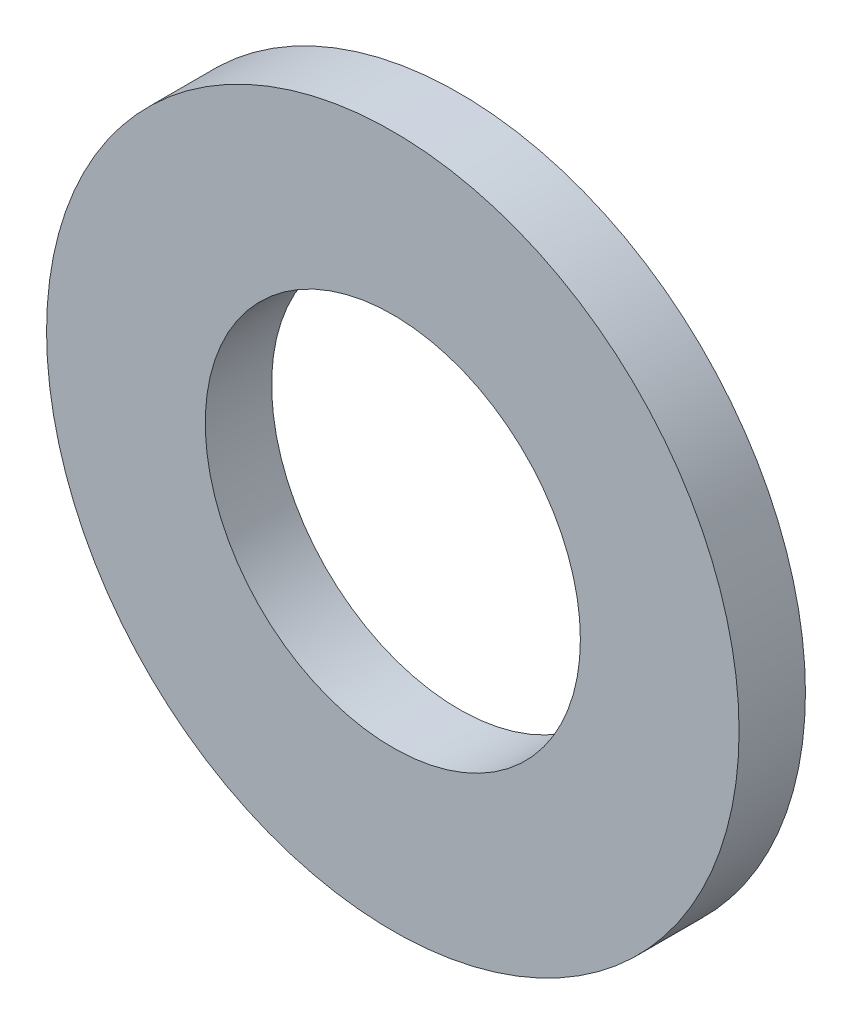
ISO-10303-21;
HEADER;
FILE_DESCRIPTION(('STEP AP214'),'2;1');
FILE_NAME('part.step','',(''),(''),'','','');
FILE_SCHEMA(('AUTOMOTIVE_DESIGN { 1 0 10303 214 1 1 1 1 }'));
ENDSEC;
DATA;
#1=APPLICATION_CONTEXT('core data for automotive mechanical design processes');
#2=APPLICATION_PROTOCOL_DEFINITION('international standard','automotive_design',2000,#1);
#3=PRODUCT_CONTEXT('',#1,'mechanical');
#4=PRODUCT('Part','Part','',(#3));
#5=PRODUCT_RELATED_PRODUCT_CATEGORY('part','',(#4));
#6=PRODUCT_DEFINITION_FORMATION('','',#4);
#7=PRODUCT_DEFINITION_CONTEXT('part definition',#1,'design');
#8=PRODUCT_DEFINITION('design','',#6,#7);
#9=PRODUCT_DEFINITION_SHAPE('','',#8);
#10=(LENGTH_UNIT() NAMED_UNIT(*) SI_UNIT(.MILLI.,.METRE.));
#11=(NAMED_UNIT(*) PLANE_ANGLE_UNIT() SI_UNIT($,.RADIAN.));
#12=(NAMED_UNIT(*) SI_UNIT($,.STERADIAN.) SOLID_ANGLE_UNIT());
#13=UNCERTAINTY_MEASURE_WITH_UNIT(LENGTH_MEASURE(1.E-05),#10,'distance_accuracy_value','');
#14=(GEOMETRIC_REPRESENTATION_CONTEXT(3) GLOBAL_UNCERTAINTY_ASSIGNED_CONTEXT((#13)) GLOBAL_UNIT_ASSIGNED_CONTEXT((#10,
#11,#12)) REPRESENTATION_CONTEXT('',''));
#15=CARTESIAN_POINT('',(0.,0.,0.));
#16=DIRECTION('',(0.,0.,1.));
#17=DIRECTION('',(1.,0.,0.));
#18=AXIS2_PLACEMENT_3D('',#15,#16,#17);
#19=CARTESIAN_POINT('',(0.,0.,-2.3));
#20=DIRECTION('',(0.,0.,1.));
#21=DIRECTION('',(1.,0.,0.));
#22=AXIS2_PLACEMENT_3D('',#19,#20,#21);
#23=CYLINDRICAL_SURFACE('',#22,12.);
#24=CARTESIAN_POINT('',(0.,0.,-2.3));
#25=DIRECTION('',(0.,0.,1.));
#26=DIRECTION('',(1.,0.,0.));
#27=AXIS2_PLACEMENT_3D('',#24,#25,#26);
#28=CIRCLE('',#27,12.);
#29=CARTESIAN_POINT('',(12.,0.,-2.3));
#30=VERTEX_POINT('',#29);
#31=EDGE_CURVE('E10',#30,#30,#28,.T.);
#32=ORIENTED_EDGE('',*,*,#31,.T.);
#33=EDGE_LOOP('',(#32));
#34=FACE_BOUND('',#33,.T.);
#35=CARTESIAN_POINT('',(0.,0.,0.));
#36=DIRECTION('',(0.,0.,1.));
#37=DIRECTION('',(1.,0.,0.));
#38=AXIS2_PLACEMENT_3D('',#35,#36,#37);
#39=CIRCLE('',#38,12.);
#40=CARTESIAN_POINT('',(12.,0.,0.));
#41=VERTEX_POINT('',#40);
#42=EDGE_CURVE('E32',#41,#41,#39,.T.);
#43=ORIENTED_EDGE('',*,*,#42,.F.);
#44=EDGE_LOOP('',(#43));
#45=FACE_BOUND('',#44,.T.);
#46=ADVANCED_FACE('F29',(#34,#45),#23,.T.);
#47=CARTESIAN_POINT('',(0.,0.,-2.3));
#48=DIRECTION('',(0.,0.,1.));
#49=DIRECTION('',(1.,0.,0.));
#50=AXIS2_PLACEMENT_3D('',#47,#48,#49);
#51=PLANE('',#50);
#52=CARTESIAN_POINT('',(0.,0.,-2.3));
#53=DIRECTION('',(0.,0.,1.));
#54=DIRECTION('',(1.,0.,0.));
#55=AXIS2_PLACEMENT_3D('',#52,#53,#54);
#56=CIRCLE('',#55,6.5);
#57=CARTESIAN_POINT('',(6.5,0.,-2.3));
#58=VERTEX_POINT('',#57);
#59=EDGE_CURVE('E39',#58,#58,#56,.T.);
#60=ORIENTED_EDGE('',*,*,#59,.T.);
#61=EDGE_LOOP('',(#60));
#62=FACE_BOUND('',#61,.T.);
#63=ORIENTED_EDGE('',*,*,#31,.F.);
#64=EDGE_LOOP('',(#63));
#65=FACE_BOUND('',#64,.T.);
#66=ADVANCED_FACE('F47',(#62,#65),#51,.F.);
#67=CARTESIAN_POINT('',(0.,0.,0.));
#68=DIRECTION('',(0.,0.,1.));
#69=DIRECTION('',(1.,0.,0.));
#70=AXIS2_PLACEMENT_3D('',#67,#68,#69);
#71=PLANE('',#70);
#72=CARTESIAN_POINT('',(0.,0.,0.));
#73=DIRECTION('',(0.,0.,1.));
#74=DIRECTION('',(1.,0.,0.));
#75=AXIS2_PLACEMENT_3D('',#72,#73,#74);
#76=CIRCLE('',#75,6.5);
#77=CARTESIAN_POINT('',(6.5,0.,0.));
#78=VERTEX_POINT('',#77);
#79=EDGE_CURVE('E41',#78,#78,#76,.T.);
#80=ORIENTED_EDGE('',*,*,#79,.F.);
#81=EDGE_LOOP('',(#80));
#82=FACE_BOUND('',#81,.T.);
#83=ORIENTED_EDGE('',*,*,#42,.T.);
#84=EDGE_LOOP('',(#83));
#85=FACE_BOUND('',#84,.T.);
#86=ADVANCED_FACE('F53',(#82,#85),#71,.T.);
#87=CARTESIAN_POINT('',(0.,0.,-2.3));
#88=DIRECTION('',(0.,0.,1.));
#89=DIRECTION('',(1.,0.,0.));
#90=AXIS2_PLACEMENT_3D('',#87,#88,#89);
#91=CYLINDRICAL_SURFACE('',#90,6.5);
#92=ORIENTED_EDGE('',*,*,#59,.F.);
#93=EDGE_LOOP('',(#92));
#94=FACE_BOUND('',#93,.T.);
#95=ORIENTED_EDGE('',*,*,#79,.T.);
#96=EDGE_LOOP('',(#95));
#97=FACE_BOUND('',#96,.T.);
#98=ADVANCED_FACE('F50',(#94,#97),#91,.F.);
#99=CLOSED_SHELL('',(#46,#66,#86,#98));
#100=MANIFOLD_SOLID_BREP('B2',#99);
#101=ADVANCED_BREP_SHAPE_REPRESENTATION('',(#18,#100),#14);
#102=SHAPE_DEFINITION_REPRESENTATION(#9,#101);
ENDSEC;
END-ISO-10303-21;
